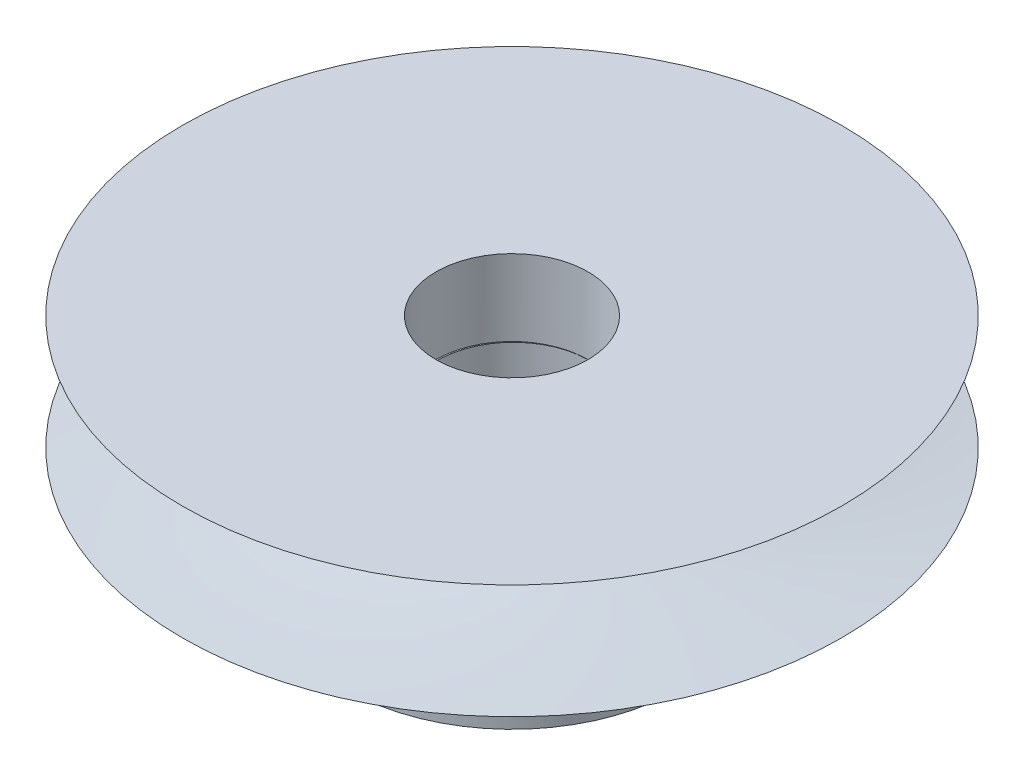
ISO-10303-21;
HEADER;
FILE_DESCRIPTION(('STEP AP214'),'2;1');
FILE_NAME('part.step','',(''),(''),'','','');
FILE_SCHEMA(('AUTOMOTIVE_DESIGN { 1 0 10303 214 1 1 1 1 }'));
ENDSEC;
DATA;
#1=APPLICATION_CONTEXT('core data for automotive mechanical design processes');
#2=APPLICATION_PROTOCOL_DEFINITION('international standard','automotive_design',2000,#1);
#3=PRODUCT_CONTEXT('',#1,'mechanical');
#4=PRODUCT('Part','Part','',(#3));
#5=PRODUCT_RELATED_PRODUCT_CATEGORY('part','',(#4));
#6=PRODUCT_DEFINITION_FORMATION('','',#4);
#7=PRODUCT_DEFINITION_CONTEXT('part definition',#1,'design');
#8=PRODUCT_DEFINITION('design','',#6,#7);
#9=PRODUCT_DEFINITION_SHAPE('','',#8);
#10=(LENGTH_UNIT() NAMED_UNIT(*) SI_UNIT(.MILLI.,.METRE.));
#11=(NAMED_UNIT(*) PLANE_ANGLE_UNIT() SI_UNIT($,.RADIAN.));
#12=(NAMED_UNIT(*) SI_UNIT($,.STERADIAN.) SOLID_ANGLE_UNIT());
#13=UNCERTAINTY_MEASURE_WITH_UNIT(LENGTH_MEASURE(1.E-05),#10,'distance_accuracy_value','');
#14=(GEOMETRIC_REPRESENTATION_CONTEXT(3) GLOBAL_UNCERTAINTY_ASSIGNED_CONTEXT((#13)) GLOBAL_UNIT_ASSIGNED_CONTEXT((#10,
#11,#12)) REPRESENTATION_CONTEXT('',''));
#15=CARTESIAN_POINT('',(0.,0.,0.));
#16=DIRECTION('',(0.,0.,1.));
#17=DIRECTION('',(1.,0.,0.));
#18=AXIS2_PLACEMENT_3D('',#15,#16,#17);
#19=CARTESIAN_POINT('',(1.81538548412725,-5.43164949076936,-0.870852952540729));
#20=DIRECTION('',(-0.991094193323921,0.,-0.133162682308544));
#21=DIRECTION('',(-0.133162682308544,0.,0.991094193323921));
#22=AXIS2_PLACEMENT_3D('',#19,#20,#21);
#23=CYLINDRICAL_SURFACE('',#22,0.799999999999998);
#24=CARTESIAN_POINT('',(11.1064637199141,-5.43164949076936,1.18467810912707));
#25=CARTESIAN_POINT('',(11.1064646215035,-5.38759773556251,1.18467715758625));
#26=CARTESIAN_POINT('',(11.1079681758369,-5.34353473995801,1.18119645745761));
#27=CARTESIAN_POINT('',(11.1138442737868,-5.25668186481119,1.16738080439189));
#28=CARTESIAN_POINT('',(11.1182182592017,-5.21389263637071,1.15704240685055));
#29=CARTESIAN_POINT('',(11.1294309386559,-5.13085686700817,1.12984311543306));
#30=CARTESIAN_POINT('',(11.1362661192587,-5.09060679712655,1.11299151686002));
#31=CARTESIAN_POINT('',(11.1518251800773,-5.01362666236658,1.0732239929227));
#32=CARTESIAN_POINT('',(11.160549210197,-4.97689687720103,1.05030758620757));
#33=CARTESIAN_POINT('',(11.1794198651729,-4.90706592839966,0.998377424258329));
#34=CARTESIAN_POINT('',(11.1895945639355,-4.87406749300912,0.969235704667135));
#35=CARTESIAN_POINT('',(11.2104378907055,-4.81354369326504,0.905879998970768));
#36=CARTESIAN_POINT('',(11.2211065714852,-4.78601891533417,0.871665470072671));
#37=CARTESIAN_POINT('',(11.2423554793976,-4.73678558614286,0.798366246817427));
#38=CARTESIAN_POINT('',(11.2529312947641,-4.71518122330387,0.75921010572635));
#39=CARTESIAN_POINT('',(11.2730802173959,-4.67907972510468,0.677508670663894));
#40=CARTESIAN_POINT('',(11.2826534922524,-4.66458140035582,0.634963945250982));
#41=CARTESIAN_POINT('',(11.3000004716948,-4.64343182174377,0.548682229759524));
#42=CARTESIAN_POINT('',(11.3078102391106,-4.63660914297522,0.504994560907715));
#43=CARTESIAN_POINT('',(11.3215216325098,-4.63046755458671,0.416803179955576));
#44=CARTESIAN_POINT('',(11.3274235835071,-4.63114736615511,0.372299608218244));
#45=CARTESIAN_POINT('',(11.3370332041084,-4.63987076948816,0.284954969708617));
#46=CARTESIAN_POINT('',(11.340793302453,-4.64772492174273,0.242100548928696));
#47=CARTESIAN_POINT('',(11.3464089200615,-4.67027018542573,0.158102323145872));
#48=CARTESIAN_POINT('',(11.3482643360579,-4.68496166749592,0.116958611009736));
#49=CARTESIAN_POINT('',(11.3503205499613,-4.72089762873939,0.0371360507078456));
#50=CARTESIAN_POINT('',(11.3505056620975,-4.74220229059902,-0.00151605280361628));
#51=CARTESIAN_POINT('',(11.3495716089676,-4.79071368831498,-0.0749042073237092));
#52=CARTESIAN_POINT('',(11.3484521920092,-4.81792156229645,-0.109639501215548));
#53=CARTESIAN_POINT('',(11.3453437934762,-4.87844633266004,-0.175265709571518));
#54=CARTESIAN_POINT('',(11.3433293443762,-4.91192417269803,-0.206007153634945));
#55=CARTESIAN_POINT('',(11.3389954568624,-4.98352888540917,-0.261472539605345));
#56=CARTESIAN_POINT('',(11.3366759994366,-5.02165604787875,-0.286196106124545));
#57=CARTESIAN_POINT('',(11.3322671337787,-5.10182101184256,-0.328986888747846));
#58=CARTESIAN_POINT('',(11.3301793197852,-5.14388263371187,-0.347009769290822));
#59=CARTESIAN_POINT('',(11.3267212896178,-5.23051243918886,-0.375523101118385));
#60=CARTESIAN_POINT('',(11.3253508992907,-5.2750800115698,-0.386015380672626));
#61=CARTESIAN_POINT('',(11.3236543691757,-5.36405977307406,-0.398870624370594));
#62=CARTESIAN_POINT('',(11.3232988586169,-5.40843837961864,-0.401462385592023));
#63=CARTESIAN_POINT('',(11.3236215561184,-5.49698323869002,-0.399065532821843));
#64=CARTESIAN_POINT('',(11.3242996556331,-5.5411495130265,-0.394077714807751));
#65=CARTESIAN_POINT('',(11.3265265787512,-5.62715035636936,-0.376882066917532));
#66=CARTESIAN_POINT('',(11.3280586606658,-5.66901324947516,-0.364812830544949));
#67=CARTESIAN_POINT('',(11.3316728733436,-5.75017302715915,-0.333987463836652));
#68=CARTESIAN_POINT('',(11.3337550752687,-5.78946957894214,-0.315230468282178));
#69=CARTESIAN_POINT('',(11.3380870701795,-5.86531936835475,-0.271145692445589));
#70=CARTESIAN_POINT('',(11.34033951372,-5.90179489825229,-0.245684581532881));
#71=CARTESIAN_POINT('',(11.3444472713721,-5.97012675707601,-0.189145504872422));
#72=CARTESIAN_POINT('',(11.3463025119562,-6.0019822304189,-0.158066501140895));
#73=CARTESIAN_POINT('',(11.3491233277562,-6.06109498990145,-0.0901911044444434));
#74=CARTESIAN_POINT('',(11.3500622517459,-6.0881967127849,-0.0532578485741481));
#75=CARTESIAN_POINT('',(11.3504333013823,-6.13589160905147,0.0246064406844519));
#76=CARTESIAN_POINT('',(11.3498655116337,-6.1564851478078,0.0655372494788946));
#77=CARTESIAN_POINT('',(11.3468303344725,-6.19038463500052,0.149875307960472));
#78=CARTESIAN_POINT('',(11.3443780920137,-6.20374724471575,0.193260271106206));
#79=CARTESIAN_POINT('',(11.3373736498844,-6.22297513734817,0.281495185539309));
#80=CARTESIAN_POINT('',(11.3328219121443,-6.22884206839295,0.326344812555753));
#81=CARTESIAN_POINT('',(11.3217968285516,-6.23281093454632,0.414758098568233));
#82=CARTESIAN_POINT('',(11.3153861693309,-6.23114371654792,0.458319361294996));
#83=CARTESIAN_POINT('',(11.300820231773,-6.22062994078406,0.544264567087746));
#84=CARTESIAN_POINT('',(11.2926650137177,-6.21178363105674,0.586648550776486));
#85=CARTESIAN_POINT('',(11.275080571494,-6.18728900088858,0.668811464340581));
#86=CARTESIAN_POINT('',(11.2656597472385,-6.17168413522901,0.708605198966532));
#87=CARTESIAN_POINT('',(11.2460555098364,-6.13415745293923,0.784887562101749));
#88=CARTESIAN_POINT('',(11.2358719880907,-6.11223473545135,0.821375718295206));
#89=CARTESIAN_POINT('',(11.2151109686642,-6.06200288376453,0.891131917566509));
#90=CARTESIAN_POINT('',(11.2045302658254,-6.03353701859925,0.92428613883046));
#91=CARTESIAN_POINT('',(11.1839963309592,-5.97132393990898,0.985447106208347));
#92=CARTESIAN_POINT('',(11.174043265389,-5.93757533352973,1.0134524905267));
#93=CARTESIAN_POINT('',(11.1553204372666,-5.8648636274237,1.06419375045383));
#94=CARTESIAN_POINT('',(11.1465813823321,-5.82580247103228,1.08680071316057));
#95=CARTESIAN_POINT('',(11.1313079144879,-5.74412355736698,1.12531187796985));
#96=CARTESIAN_POINT('',(11.1247720476226,-5.70150816890452,1.14122050225761));
#97=CARTESIAN_POINT('',(11.1153480813859,-5.621148415059,1.16384406383107));
#98=CARTESIAN_POINT('',(11.1120370641733,-5.58375425542506,1.17164013695043));
#99=CARTESIAN_POINT('',(11.1075946184198,-5.50812598594202,1.18205727268292));
#100=CARTESIAN_POINT('',(11.1064629372208,-5.46989197397983,1.1846789351846));
#101=CARTESIAN_POINT('',(11.1064637199141,-5.43164949076936,1.18467810912707));
#102=B_SPLINE_CURVE_WITH_KNOTS('',3,(#24,#25,#26,#27,#28,#29,#30,#31,#32,#33,#34,#35,#36,#37,
#38,#39,#40,#41,#42,#43,#44,#45,#46,#47,#48,#49,#50,#51,#52,#53,#54,#55,#56,#57,#58,#59,#60,#61,
#62,#63,#64,#65,#66,#67,#68,#69,#70,#71,#72,#73,#74,#75,#76,#77,#78,#79,#80,#81,#82,#83,#84,#85,
#86,#87,#88,#89,#90,#91,#92,#93,#94,#95,#96,#97,#98,#99,#100,#101),.UNSPECIFIED.,.T.,.F.,(4,2,2,
2,2,2,2,2,2,2,2,2,2,2,2,2,2,2,2,2,2,2,2,2,2,2,2,2,2,2,2,2,2,2,2,2,2,2,4),(0.,0.132014575271934,
0.264095511399198,0.395988640365317,0.527892240547885,0.662825651698496,0.797773511219596,
0.934962594591386,1.07212870779235,1.20616650785879,1.34018146131782,1.47075691547637,
1.60133944876582,1.73314701668557,1.86498001940561,2.00083181327421,2.13669207923951,
2.27343591809643,2.41014654721941,2.54285854682594,2.67555661050479,2.80574034782946,
2.93594093359374,3.06895730921438,3.20199828662668,3.33880269890164,3.47559942953329,
3.6113081053336,3.7469869367745,3.8785372306771,4.01008297970094,4.1407952147677,
4.27152609722201,4.40579373526754,4.54009683430422,4.67734280436968,4.81449802321737,
4.92911662480865,5.04372193746119),.UNSPECIFIED.);
#103=CARTESIAN_POINT('',(11.1064637199141,-5.43164949076936,1.18467810912707));
#104=VERTEX_POINT('',#103);
#105=EDGE_CURVE('E40',#104,#104,#102,.T.);
#106=ORIENTED_EDGE('',*,*,#105,.T.);
#107=EDGE_LOOP('',(#106));
#108=FACE_BOUND('',#107,.T.);
#109=CARTESIAN_POINT('',(14.6232276632152,-5.43164949076936,1.65718790980036));
#110=CARTESIAN_POINT('',(14.6232285423907,-5.38689388208723,1.65718610338816));
#111=CARTESIAN_POINT('',(14.6241932172446,-5.34211011048688,1.65351536227793));
#112=CARTESIAN_POINT('',(14.6279879225404,-5.25378835530042,1.63892462455044));
#113=CARTESIAN_POINT('',(14.6308199146819,-5.21025173214282,1.62799700417297));
#114=CARTESIAN_POINT('',(14.6381507130368,-5.1257158485961,1.59920370558382));
#115=CARTESIAN_POINT('',(14.642648402077,-5.08471490899901,1.58134267718221));
#116=CARTESIAN_POINT('',(14.6530073040293,-5.0063739620068,1.53917613265695));
#117=CARTESIAN_POINT('',(14.6588682794177,-4.96903331849192,1.51487173904977));
#118=CARTESIAN_POINT('',(14.6716068562294,-4.89886477627407,1.46033985308055));
#119=CARTESIAN_POINT('',(14.6784891935206,-4.86605935393636,1.43008454254686));
#120=CARTESIAN_POINT('',(14.6928249730675,-4.80608656379418,1.36453726206844));
#121=CARTESIAN_POINT('',(14.7002784434357,-4.77891947376611,1.32924504412141));
#122=CARTESIAN_POINT('',(14.7153491757765,-4.73091419341167,1.2544572869117));
#123=CARTESIAN_POINT('',(14.72296688137,-4.71009629970239,1.21494880164004));
#124=CARTESIAN_POINT('',(14.7379360486431,-4.67551033759991,1.13291094451407));
#125=CARTESIAN_POINT('',(14.7452875197957,-4.66174201814593,1.09038168030203));
#126=CARTESIAN_POINT('',(14.7593425038368,-4.64171306797088,1.00371794896085));
#127=CARTESIAN_POINT('',(14.7660490831124,-4.63541510978355,0.959592607799138));
#128=CARTESIAN_POINT('',(14.7785994402972,-4.63038999645085,0.870792422805709));
#129=CARTESIAN_POINT('',(14.7844432507854,-4.63166255535966,0.826117599792069));
#130=CARTESIAN_POINT('',(14.7950849286729,-4.64171239317647,0.737740465696337));
#131=CARTESIAN_POINT('',(14.7998882190077,-4.65044952818574,0.694034233195488));
#132=CARTESIAN_POINT('',(14.8084401951434,-4.67511777493138,0.608593787501458));
#133=CARTESIAN_POINT('',(14.8121888616132,-4.69104901852023,0.566859610467281));
#134=CARTESIAN_POINT('',(14.818686810666,-4.72969609794835,0.486444010430453));
#135=CARTESIAN_POINT('',(14.8214334868195,-4.75242935216511,0.44777075117003));
#136=CARTESIAN_POINT('',(14.8260382059198,-4.8040224711038,0.374693012350333));
#137=CARTESIAN_POINT('',(14.8278962098182,-4.83288260496094,0.340288720419042));
#138=CARTESIAN_POINT('',(14.830908169946,-4.89613519918013,0.276519536058027));
#139=CARTESIAN_POINT('',(14.8320574378078,-4.93056263788654,0.247189106186187));
#140=CARTESIAN_POINT('',(14.8338320988496,-5.00385228459629,0.194701435202917));
#141=CARTESIAN_POINT('',(14.8344574905101,-5.04271450546203,0.171544211996561));
#142=CARTESIAN_POINT('',(14.835374044976,-5.12380105148705,0.132086417340071));
#143=CARTESIAN_POINT('',(14.8356650753751,-5.16602670148361,0.115788563802393));
#144=CARTESIAN_POINT('',(14.8360633118534,-5.25262571324516,0.0905641895641914));
#145=CARTESIAN_POINT('',(14.8361705264048,-5.29699897592803,0.0816373291385821));
#146=CARTESIAN_POINT('',(14.8362896290041,-5.38632666118881,0.0714669594083169));
#147=CARTESIAN_POINT('',(14.8363021284823,-5.43127547653657,0.0701741805181361));
#148=CARTESIAN_POINT('',(14.8362464508406,-5.52074740301057,0.0751805424654309));
#149=CARTESIAN_POINT('',(14.8361782753658,-5.56527052279879,0.0814795284940992));
#150=CARTESIAN_POINT('',(14.8358988536232,-5.65248110194662,0.10144044943636));
#151=CARTESIAN_POINT('',(14.8356880686569,-5.69517400949202,0.115078615158611));
#152=CARTESIAN_POINT('',(14.8349962093295,-5.77768258333974,0.149288353446227));
#153=CARTESIAN_POINT('',(14.8345151258527,-5.81749815255307,0.169860159838414));
#154=CARTESIAN_POINT('',(14.8331054192907,-5.89334332008084,0.217449179952169));
#155=CARTESIAN_POINT('',(14.8321745429946,-5.9293527327057,0.244498494502588));
#156=CARTESIAN_POINT('',(14.8296675182739,-5.99635760013778,0.304198701990065));
#157=CARTESIAN_POINT('',(14.8280913458281,-6.02735286823351,0.336849803427388));
#158=CARTESIAN_POINT('',(14.8240954174176,-6.08362105686695,0.407009497784259));
#159=CARTESIAN_POINT('',(14.8216711099469,-6.10886186416613,0.444543598526803));
#160=CARTESIAN_POINT('',(14.8158312504636,-6.15268257787918,0.523247496623109));
#161=CARTESIAN_POINT('',(14.8124157177072,-6.17126261367381,0.564417223338058));
#162=CARTESIAN_POINT('',(14.804524556844,-6.20118117293371,0.649093133566165));
#163=CARTESIAN_POINT('',(14.8000517012225,-6.21253835331013,0.692592980196058));
#164=CARTESIAN_POINT('',(14.7900553801637,-6.22774953022037,0.780767484098668));
#165=CARTESIAN_POINT('',(14.7845319600101,-6.2316038500773,0.825442090662999));
#166=CARTESIAN_POINT('',(14.7725932641062,-6.23169403092554,0.914381634596473));
#167=CARTESIAN_POINT('',(14.7661840440878,-6.22797944776823,0.958647342789999));
#168=CARTESIAN_POINT('',(14.7526669105414,-6.21314210098296,1.04580857745071));
#169=CARTESIAN_POINT('',(14.7455589973586,-6.20201934101534,1.08870410459488));
#170=CARTESIAN_POINT('',(14.7309572839263,-6.17269672960967,1.17191640578135));
#171=CARTESIAN_POINT('',(14.723463608032,-6.15449914658373,1.21223400156988));
#172=CARTESIAN_POINT('',(14.7084659455005,-6.11154858667805,1.2892078841463));
#173=CARTESIAN_POINT('',(14.7009619587625,-6.08679554525455,1.32586413488042));
#174=CARTESIAN_POINT('',(14.6863141325435,-6.03125302080083,1.39475152648839));
#175=CARTESIAN_POINT('',(14.6791728472817,-6.00042664862577,1.4269534691128));
#176=CARTESIAN_POINT('',(14.6657308394642,-5.9336888633646,1.48580002728916));
#177=CARTESIAN_POINT('',(14.6594303166723,-5.89777624595848,1.51244332296023));
#178=CARTESIAN_POINT('',(14.6480534605966,-5.82173354753015,1.55953020684399));
#179=CARTESIAN_POINT('',(14.6429817445171,-5.78158834903103,1.57995048409934));
#180=CARTESIAN_POINT('',(14.6344397952977,-5.69835031402823,1.61387478872132));
#181=CARTESIAN_POINT('',(14.6309678131482,-5.65526075612353,1.62738637123598));
#182=CARTESIAN_POINT('',(14.626702664487,-5.58189625962208,1.64387832601437));
#183=CARTESIAN_POINT('',(14.6254035894691,-5.55208487697699,1.64886257883413));
#184=CARTESIAN_POINT('',(14.6236657951211,-5.49206977036485,1.65551796868654));
#185=CARTESIAN_POINT('',(14.6232270696436,-5.46186604920267,1.65718912939186));
#186=CARTESIAN_POINT('',(14.6232276632152,-5.43164949076936,1.65718790980036));
#187=B_SPLINE_CURVE_WITH_KNOTS('',3,(#109,#110,#111,#112,#113,#114,#115,#116,#117,#118,#119,
#120,#121,#122,#123,#124,#125,#126,#127,#128,#129,#130,#131,#132,#133,#134,#135,#136,#137,#138,
#139,#140,#141,#142,#143,#144,#145,#146,#147,#148,#149,#150,#151,#152,#153,#154,#155,#156,#157,
#158,#159,#160,#161,#162,#163,#164,#165,#166,#167,#168,#169,#170,#171,#172,#173,#174,#175,#176,
#177,#178,#179,#180,#181,#182,#183,#184,#185,#186),.UNSPECIFIED.,.T.,.F.,(4,2,2,2,2,2,2,2,2,2,2,
2,2,2,2,2,2,2,2,2,2,2,2,2,2,2,2,2,2,2,2,2,2,2,2,2,2,2,4),(0.,0.134156444816222,
0.268454051962342,0.402661749135058,0.536846080960288,0.671673254094057,0.806507068006988,
0.941767496346315,1.07702310723883,1.21159999492362,1.34617179953998,1.48002441067543,
1.6138794751396,1.74808028857725,1.8822869982689,2.01737223537042,2.15245786427561,
2.28759696836332,2.42272984361512,2.55698962354853,2.69124666574639,2.82507148757523,
2.95890082290074,3.09340763033806,3.22791944524748,3.36316447844813,3.49840688446776,
3.63329851994902,3.76818434237438,3.90218986536058,4.0361953221355,4.17015784790922,
4.3041216927006,4.43892581295428,4.57376190562698,4.70909704556757,4.84428386868606,
4.93485966775244,5.02543481963532),.UNSPECIFIED.);
#188=CARTESIAN_POINT('',(14.6232276632152,-5.43164949076936,1.65718790980036));
#189=VERTEX_POINT('',#188);
#190=EDGE_CURVE('E99',#189,#189,#187,.T.);
#191=ORIENTED_EDGE('',*,*,#190,.F.);
#192=EDGE_LOOP('',(#191));
#193=FACE_BOUND('',#192,.T.);
#194=ADVANCED_FACE('F35',(#108,#193),#23,.F.);
#195=CARTESIAN_POINT('',(-4.7030891410279,1.56463653790778,0.));
#196=CARTESIAN_POINT('',(8.2969108589721,-1.43536346209222,0.));
#197=CARTESIAN_POINT('',(-4.7030891410279,-2.93536346209222,0.));
#198=B_SPLINE_CURVE_WITH_KNOTS('',2,(#195,#196,#197),.UNSPECIFIED.,.F.,.F.,(3,3),(0.,1.),.UNSPECIFIED.);
#199=CARTESIAN_POINT('',(8.2969108589721,-2.93536346209222,0.));
#200=DIRECTION('',(0.,-1.,0.));
#201=AXIS1_PLACEMENT('',#199,#200);
#202=SURFACE_OF_REVOLUTION('',#198,#201);
#203=CARTESIAN_POINT('',(8.2969108589721,-2.93536346209222,0.));
#204=DIRECTION('',(0.,-1.,0.));
#205=DIRECTION('',(0.,0.,-1.));
#206=AXIS2_PLACEMENT_3D('',#203,#204,#205);
#207=CIRCLE('',#206,13.);
#208=CARTESIAN_POINT('',(8.2969108589721,-2.93536346209222,-13.));
#209=VERTEX_POINT('',#208);
#210=EDGE_CURVE('E80',#209,#209,#207,.T.);
#211=ORIENTED_EDGE('',*,*,#210,.F.);
#212=EDGE_LOOP('',(#211));
#213=FACE_BOUND('',#212,.T.);
#214=CARTESIAN_POINT('',(8.2969108589721,1.56463653790778,0.));
#215=DIRECTION('',(0.,-1.,0.));
#216=DIRECTION('',(0.,0.,-1.));
#217=AXIS2_PLACEMENT_3D('',#214,#215,#216);
#218=CIRCLE('',#217,13.);
#219=CARTESIAN_POINT('',(8.2969108589721,1.56463653790778,-13.));
#220=VERTEX_POINT('',#219);
#221=EDGE_CURVE('E78',#220,#220,#218,.T.);
#222=ORIENTED_EDGE('',*,*,#221,.T.);
#223=EDGE_LOOP('',(#222));
#224=FACE_BOUND('',#223,.T.);
#225=ADVANCED_FACE('F37',(#213,#224),#202,.T.);
#226=CARTESIAN_POINT('',(-4.7030891410279,-2.93536346209222,0.));
#227=DIRECTION('',(0.,1.,0.));
#228=DIRECTION('',(0.,0.,1.));
#229=AXIS2_PLACEMENT_3D('',#226,#227,#228);
#230=PLANE('',#229);
#231=CARTESIAN_POINT('',(8.29691086,-2.93536346209222,0.));
#232=DIRECTION('',(0.,-1.,0.));
#233=DIRECTION('',(0.,0.,-1.));
#234=AXIS2_PLACEMENT_3D('',#231,#232,#233);
#235=CIRCLE('',#234,6.53976727896577);
#236=CARTESIAN_POINT('',(8.29691086,-2.93536346209222,-6.53976727896577));
#237=VERTEX_POINT('',#236);
#238=EDGE_CURVE('E49',#237,#237,#235,.T.);
#239=ORIENTED_EDGE('',*,*,#238,.F.);
#240=EDGE_LOOP('',(#239));
#241=FACE_BOUND('',#240,.T.);
#242=ORIENTED_EDGE('',*,*,#210,.T.);
#243=EDGE_LOOP('',(#242));
#244=FACE_BOUND('',#243,.T.);
#245=ADVANCED_FACE('F139',(#241,#244),#230,.F.);
#246=CARTESIAN_POINT('',(-4.7030891410279,1.56463653790778,0.));
#247=DIRECTION('',(0.,1.,0.));
#248=DIRECTION('',(0.,0.,1.));
#249=AXIS2_PLACEMENT_3D('',#246,#247,#248);
#250=PLANE('',#249);
#251=CARTESIAN_POINT('',(8.29691086,1.56463653790778,0.));
#252=DIRECTION('',(0.,1.,0.));
#253=DIRECTION('',(0.,0.,1.));
#254=AXIS2_PLACEMENT_3D('',#251,#252,#253);
#255=CIRCLE('',#254,3.);
#256=CARTESIAN_POINT('',(8.29691086,1.56463653790778,3.));
#257=VERTEX_POINT('',#256);
#258=EDGE_CURVE('E74',#257,#257,#255,.T.);
#259=ORIENTED_EDGE('',*,*,#258,.F.);
#260=EDGE_LOOP('',(#259));
#261=FACE_BOUND('',#260,.T.);
#262=ORIENTED_EDGE('',*,*,#221,.F.);
#263=EDGE_LOOP('',(#262));
#264=FACE_BOUND('',#263,.T.);
#265=ADVANCED_FACE('F142',(#261,#264),#250,.T.);
#266=CARTESIAN_POINT('',(8.29691086,-1.43536346209222,0.));
#267=DIRECTION('',(0.,1.,0.));
#268=DIRECTION('',(0.,0.,1.));
#269=AXIS2_PLACEMENT_3D('',#266,#267,#268);
#270=CYLINDRICAL_SURFACE('',#269,3.);
#271=CARTESIAN_POINT('',(8.29691086,-1.43536346209222,0.));
#272=DIRECTION('',(0.,1.,0.));
#273=DIRECTION('',(0.,0.,1.));
#274=AXIS2_PLACEMENT_3D('',#271,#272,#273);
#275=CIRCLE('',#274,3.);
#276=CARTESIAN_POINT('',(8.32359642051543,-1.43536346209222,2.99988131112882));
#277=VERTEX_POINT('',#276);
#278=CARTESIAN_POINT('',(8.32359642051543,-1.43536346209222,-2.99988131112882));
#279=VERTEX_POINT('',#278);
#280=EDGE_CURVE('E61',#277,#279,#275,.T.);
#281=ORIENTED_EDGE('',*,*,#280,.F.);
#282=EDGE_CURVE('E71',#279,#277,#275,.T.);
#283=ORIENTED_EDGE('',*,*,#282,.F.);
#284=EDGE_LOOP('',(#281,#283));
#285=FACE_BOUND('',#284,.T.);
#286=ORIENTED_EDGE('',*,*,#258,.T.);
#287=EDGE_LOOP('',(#286));
#288=FACE_BOUND('',#287,.T.);
#289=ADVANCED_FACE('F76',(#285,#288),#270,.F.);
#290=CARTESIAN_POINT('',(8.29691086,-1.43536346209222,0.));
#291=DIRECTION('',(0.,1.,0.));
#292=DIRECTION('',(0.,0.,1.));
#293=AXIS2_PLACEMENT_3D('',#290,#291,#292);
#294=PLANE('',#293);
#295=CARTESIAN_POINT('',(8.35028198103061,-1.43536346209222,0.));
#296=DIRECTION('',(0.,1.,0.));
#297=DIRECTION('',(0.,0.,1.));
#298=AXIS2_PLACEMENT_3D('',#295,#296,#297);
#299=CIRCLE('',#298,3.);
#300=EDGE_CURVE('E63',#279,#277,#299,.T.);
#301=ORIENTED_EDGE('',*,*,#300,.F.);
#302=ORIENTED_EDGE('',*,*,#282,.T.);
#303=EDGE_LOOP('',(#301,#302));
#304=FACE_BOUND('',#303,.T.);
#305=ADVANCED_FACE('F72',(#304),#294,.T.);
#306=CARTESIAN_POINT('',(8.29691086,-7.93536346209222,0.));
#307=DIRECTION('',(0.,1.,0.));
#308=DIRECTION('',(0.,0.,1.));
#309=AXIS2_PLACEMENT_3D('',#306,#307,#308);
#310=CYLINDRICAL_SURFACE('',#309,6.53976727896577);
#311=ORIENTED_EDGE('',*,*,#190,.T.);
#312=EDGE_LOOP('',(#311));
#313=FACE_BOUND('',#312,.T.);
#314=CARTESIAN_POINT('',(1.75753376509114,-5.43164949076936,-0.0714372004820922));
#315=CARTESIAN_POINT('',(1.75753339390409,-5.47640509945149,-0.0714391748920874));
#316=CARTESIAN_POINT('',(1.7575718359038,-5.52118887105184,-0.0752343639631053));
#317=CARTESIAN_POINT('',(1.75776298493084,-5.6095106262383,-0.090309272843873));
#318=CARTESIAN_POINT('',(1.75791581214776,-5.6530472493959,-0.101596863837775));
#319=CARTESIAN_POINT('',(1.75844509020798,-5.73758313294262,-0.131304009659915));
#320=CARTESIAN_POINT('',(1.75882139127056,-5.77858407253971,-0.149718784699975));
#321=CARTESIAN_POINT('',(1.75995987158675,-5.85692501953192,-0.193124178252256));
#322=CARTESIAN_POINT('',(1.76072198364819,-5.8942656630468,-0.218113651362388));
#323=CARTESIAN_POINT('',(1.76282905875174,-5.96443420526465,-0.274073978032768));
#324=CARTESIAN_POINT('',(1.76417679658596,-5.99723962760236,-0.305072913253345));
#325=CARTESIAN_POINT('',(1.76765086529169,-6.05721241774454,-0.372079565161665));
#326=CARTESIAN_POINT('',(1.76977723450876,-6.08437950777261,-0.408087528476787));
#327=CARTESIAN_POINT('',(1.77498147160936,-6.13238478812706,-0.484200940684797));
#328=CARTESIAN_POINT('',(1.77806232874947,-6.15320268183633,-0.524318993556941));
#329=CARTESIAN_POINT('',(1.78527821836391,-6.18778864393881,-0.607398575330946));
#330=CARTESIAN_POINT('',(1.78941321328874,-6.20155696339279,-0.650360002908436));
#331=CARTESIAN_POINT('',(1.79873188078588,-6.22158591356784,-0.737660102235137));
#332=CARTESIAN_POINT('',(1.80391018688819,-6.22788387175517,-0.781990781049342));
#333=CARTESIAN_POINT('',(1.81524404471924,-6.23290898508787,-0.870954413995605));
#334=CARTESIAN_POINT('',(1.8213995595293,-6.23163642617906,-0.915587356647258));
#335=CARTESIAN_POINT('',(1.83446274033532,-6.22158658836225,-1.00363913940301));
#336=CARTESIAN_POINT('',(1.84136621079027,-6.21284945335298,-1.04706319325725));
#337=CARTESIAN_POINT('',(1.85566983366377,-6.18818120660734,-1.13173085195236));
#338=CARTESIAN_POINT('',(1.86306999518348,-6.17224996301849,-1.1729744168141));
#339=CARTESIAN_POINT('',(1.87802847418032,-6.13360288359037,-1.25225326630926));
#340=CARTESIAN_POINT('',(1.88558715080243,-6.11086962937361,-1.29027998874807));
#341=CARTESIAN_POINT('',(1.90043486279376,-6.05927651043492,-1.36198148662375));
#342=CARTESIAN_POINT('',(1.9077238863014,-6.03041637657778,-1.39565607077983));
#343=CARTESIAN_POINT('',(1.92165084496759,-5.9671637823586,-1.4579587240154));
#344=CARTESIAN_POINT('',(1.92828420570907,-5.93273634365218,-1.48655231522669));
#345=CARTESIAN_POINT('',(1.94042678795012,-5.85944669694243,-1.53764695999089));
#346=CARTESIAN_POINT('',(1.94593600618917,-5.8205844760767,-1.56014799587266));
#347=CARTESIAN_POINT('',(1.95546698084669,-5.73949793005167,-1.59844836340772));
#348=CARTESIAN_POINT('',(1.95948814757316,-5.69727228005511,-1.61424503858912));
#349=CARTESIAN_POINT('',(1.96576209682292,-5.61067326829357,-1.63867995640795));
#350=CARTESIAN_POINT('',(1.96801496084608,-5.5663000056107,-1.64731852895852));
#351=CARTESIAN_POINT('',(1.97058458708726,-5.47697232034991,-1.65715964814589));
#352=CARTESIAN_POINT('',(1.97091376443987,-5.43202350500215,-1.65840987843123));
#353=CARTESIAN_POINT('',(1.96964602062585,-5.34255157852815,-1.6535663687978));
#354=CARTESIAN_POINT('',(1.96804913873479,-5.29802845873993,-1.64747277863184));
#355=CARTESIAN_POINT('',(1.96304989550388,-5.2108178795921,-1.62814600941162));
#356=CARTESIAN_POINT('',(1.95965336318417,-5.1681249720467,-1.614935878346));
#357=CARTESIAN_POINT('',(1.95129090507569,-5.08561639819898,-1.58175675603362));
#358=CARTESIAN_POINT('',(1.94632492635999,-5.04580082898565,-1.56178753684647));
#359=CARTESIAN_POINT('',(1.93512334875583,-4.96995566145788,-1.515514145279));
#360=CARTESIAN_POINT('',(1.92888145004226,-4.93394624883302,-1.48917841576992));
#361=CARTESIAN_POINT('',(1.9155414840795,-4.86694138140094,-1.43093371425029));
#362=CARTESIAN_POINT('',(1.9084433849652,-4.83594611330521,-1.39902453479339));
#363=CARTESIAN_POINT('',(1.89377870091691,-4.77967792467177,-1.33029828654808));
#364=CARTESIAN_POINT('',(1.8862097731917,-4.75443711737259,-1.29345541317541));
#365=CARTESIAN_POINT('',(1.87106835326513,-4.71061640365954,-1.21600126585621));
#366=CARTESIAN_POINT('',(1.86349586113587,-4.69203636786491,-1.17539006512604));
#367=CARTESIAN_POINT('',(1.84875666036845,-4.66211780860501,-1.09163425247125));
#368=CARTESIAN_POINT('',(1.84158895021275,-4.6507606282286,-1.04849648450211));
#369=CARTESIAN_POINT('',(1.82795678485292,-4.63554945131835,-0.96081048994891));
#370=CARTESIAN_POINT('',(1.82149229935585,-4.63169513146142,-0.916262324227641));
#371=CARTESIAN_POINT('',(1.80953168828338,-4.63160495061318,-0.827325724800008));
#372=CARTESIAN_POINT('',(1.80402951827851,-4.63531953377049,-0.782938146037969));
#373=CARTESIAN_POINT('',(1.79406075718562,-4.65015688055576,-0.695300154680545));
#374=CARTESIAN_POINT('',(1.78959416558592,-4.66127964052338,-0.652049741523305));
#375=CARTESIAN_POINT('',(1.78171385508749,-4.69060225192905,-0.567934357613135));
#376=CARTESIAN_POINT('',(1.77829979934093,-4.70879983495499,-0.527068627080866));
#377=CARTESIAN_POINT('',(1.77244804833165,-4.75175039486067,-0.448865906601185));
#378=CARTESIAN_POINT('',(1.77001036268266,-4.77650343628417,-0.41152895140231));
#379=CARTESIAN_POINT('',(1.76595563994075,-4.83204596073789,-0.341218278251094));
#380=CARTESIAN_POINT('',(1.76434384619378,-4.86287233291295,-0.308273397239116));
#381=CARTESIAN_POINT('',(1.76177638226976,-4.92961011817412,-0.24796574339345));
#382=CARTESIAN_POINT('',(1.76082086780073,-4.96552273558024,-0.220604296359939));
#383=CARTESIAN_POINT('',(1.75936549936706,-5.04156543400857,-0.172184368739466));
#384=CARTESIAN_POINT('',(1.75886734495484,-5.08171063250768,-0.151149591123377));
#385=CARTESIAN_POINT('',(1.75815191766239,-5.16494866751048,-0.116173720807695));
#386=CARTESIAN_POINT('',(1.75793433755607,-5.20803822541519,-0.102224879243078));
#387=CARTESIAN_POINT('',(1.7576951148712,-5.28140272191664,-0.0851920040300962));
#388=CARTESIAN_POINT('',(1.75763250762501,-5.31121410456173,-0.0800416203156364));
#389=CARTESIAN_POINT('',(1.75755195819723,-5.37122921117388,-0.0731635642622601));
#390=CARTESIAN_POINT('',(1.7575340156965,-5.40143293233605,-0.0714358674675998));
#391=CARTESIAN_POINT('',(1.75753376509114,-5.43164949076936,-0.0714372004820922));
#392=B_SPLINE_CURVE_WITH_KNOTS('',3,(#314,#315,#316,#317,#318,#319,#320,#321,#322,#323,#324,
#325,#326,#327,#328,#329,#330,#331,#332,#333,#334,#335,#336,#337,#338,#339,#340,#341,#342,#343,
#344,#345,#346,#347,#348,#349,#350,#351,#352,#353,#354,#355,#356,#357,#358,#359,#360,#361,#362,
#363,#364,#365,#366,#367,#368,#369,#370,#371,#372,#373,#374,#375,#376,#377,#378,#379,#380,#381,
#382,#383,#384,#385,#386,#387,#388,#389,#390,#391),.UNSPECIFIED.,.T.,.F.,(4,2,2,2,2,2,2,2,2,2,2,
2,2,2,2,2,2,2,2,2,2,2,2,2,2,2,2,2,2,2,2,2,2,2,2,2,2,2,4),(0.,0.134156444816222,
0.268454051962342,0.402661749135058,0.536846080960288,0.671673254094056,0.806507068006987,
0.941767496346315,1.07702310723883,1.21159999492362,1.34617179953998,1.48002441067543,
1.6138794751396,1.74808028857725,1.8822869982689,2.01737223537042,2.15245786427561,
2.28759696836332,2.42272984361512,2.55698962354853,2.69124666574639,2.82507148757523,
2.95890082290074,3.09340763033806,3.22791944524748,3.36316447844813,3.49840688446776,
3.63329851994902,3.76818434237438,3.90218986536058,4.0361953221355,4.17015784790922,
4.30412169270059,4.43892581295428,4.57376190562698,4.70909704556756,4.84428386868606,
4.93485966775244,5.02543481963532),.UNSPECIFIED.);
#393=CARTESIAN_POINT('',(1.75753376509114,-5.43164949076936,-0.0714372004820922));
#394=VERTEX_POINT('',#393);
#395=EDGE_CURVE('E11',#394,#394,#392,.T.);
#396=ORIENTED_EDGE('',*,*,#395,.T.);
#397=EDGE_LOOP('',(#396));
#398=FACE_BOUND('',#397,.T.);
#399=CARTESIAN_POINT('',(8.29691086,-7.93536346209222,0.));
#400=DIRECTION('',(0.,-1.,0.));
#401=DIRECTION('',(0.,0.,-1.));
#402=AXIS2_PLACEMENT_3D('',#399,#400,#401);
#403=CIRCLE('',#402,6.53976727896577);
#404=CARTESIAN_POINT('',(8.29691086,-7.93536346209222,-6.53976727896577));
#405=VERTEX_POINT('',#404);
#406=EDGE_CURVE('E86',#405,#405,#403,.T.);
#407=ORIENTED_EDGE('',*,*,#406,.F.);
#408=EDGE_LOOP('',(#407));
#409=FACE_BOUND('',#408,.T.);
#410=ORIENTED_EDGE('',*,*,#238,.T.);
#411=EDGE_LOOP('',(#410));
#412=FACE_BOUND('',#411,.T.);
#413=ADVANCED_FACE('F102',(#313,#398,#409,#412),#310,.T.);
#414=CARTESIAN_POINT('',(8.29691086,-7.93536346209222,0.));
#415=DIRECTION('',(0.,-1.,0.));
#416=DIRECTION('',(0.,0.,-1.));
#417=AXIS2_PLACEMENT_3D('',#414,#415,#416);
#418=PLANE('',#417);
#419=CARTESIAN_POINT('',(8.35028198103061,-7.93536346209222,0.));
#420=DIRECTION('',(0.,-1.,0.));
#421=DIRECTION('',(0.,0.,-1.));
#422=AXIS2_PLACEMENT_3D('',#419,#420,#421);
#423=CIRCLE('',#422,3.);
#424=CARTESIAN_POINT('',(8.35028198103061,-7.93536346209222,-3.));
#425=VERTEX_POINT('',#424);
#426=EDGE_CURVE('E121',#425,#425,#423,.T.);
#427=ORIENTED_EDGE('',*,*,#426,.F.);
#428=EDGE_LOOP('',(#427));
#429=FACE_BOUND('',#428,.T.);
#430=ORIENTED_EDGE('',*,*,#406,.T.);
#431=EDGE_LOOP('',(#430));
#432=FACE_BOUND('',#431,.T.);
#433=ADVANCED_FACE('F109',(#429,#432),#418,.T.);
#434=CARTESIAN_POINT('',(5.3791471649988,-5.43164949076936,0.415160095582027));
#435=CARTESIAN_POINT('',(5.37914654654655,-5.47570124597621,0.415158939809546));
#436=CARTESIAN_POINT('',(5.37861505822537,-5.51976424158072,0.411404812855952));
#437=CARTESIAN_POINT('',(5.37659404402947,-5.60661711672753,0.396528109646965));
#438=CARTESIAN_POINT('',(5.3751040367044,-5.64940634516801,0.385401830381004));
#439=CARTESIAN_POINT('',(5.37146835921765,-5.73244211453055,0.356207524714163));
#440=CARTESIAN_POINT('',(5.36932362436184,-5.77269218441217,0.338149391346119));
#441=CARTESIAN_POINT('',(5.364813137431,-5.84967231917214,0.295685337826613));
#442=CARTESIAN_POINT('',(5.36244736782255,-5.88640210433769,0.271278913827546));
#443=CARTESIAN_POINT('',(5.35795310224124,-5.95623305313906,0.216209458444556));
#444=CARTESIAN_POINT('',(5.35583130463465,-5.9892314885296,0.185415590701808));
#445=CARTESIAN_POINT('',(5.35245013979262,-6.04975528827368,0.118805100240931));
#446=CARTESIAN_POINT('',(5.35119086492864,-6.07728006620455,0.0829879400504081));
#447=CARTESIAN_POINT('',(5.35004312920192,-6.12651339539586,0.00667952033150683));
#448=CARTESIAN_POINT('',(5.35017778226103,-6.14811775823485,-0.0338794875997154));
#449=CARTESIAN_POINT('',(5.35230881467969,-6.18421925643404,-0.118001793056199));
#450=CARTESIAN_POINT('',(5.35430488231846,-6.1987175811829,-0.161564586423015));
#451=CARTESIAN_POINT('',(5.36034746928501,-6.21986715979495,-0.249365151721183));
#452=CARTESIAN_POINT('',(5.36434618622529,-6.2266898385635,-0.293564870494327));
#453=CARTESIAN_POINT('',(5.37439948755559,-6.23283142695201,-0.382247749989495));
#454=CARTESIAN_POINT('',(5.3804537214089,-6.23215161538361,-0.426730861114998));
#455=CARTESIAN_POINT('',(5.39423982715559,-6.22342821205056,-0.513514350171495));
#456=CARTESIAN_POINT('',(5.40192465451,-6.21557405979599,-0.55584144726634));
#457=CARTESIAN_POINT('',(5.41867982010453,-6.19302879611299,-0.638342971626122));
#458=CARTESIAN_POINT('',(5.42775023343735,-6.17833731404281,-0.67851728205994));
#459=CARTESIAN_POINT('',(5.44683638829663,-6.14240135279933,-0.756051712098815));
#460=CARTESIAN_POINT('',(5.45686019995858,-6.1210966909397,-0.793381895223593));
#461=CARTESIAN_POINT('',(5.47713218915645,-6.07258529322374,-0.863920821591068));
#462=CARTESIAN_POINT('',(5.4873804096148,-6.04537741924227,-0.897128768132761));
#463=CARTESIAN_POINT('',(5.50770083889527,-5.98485264887869,-0.959607096523325));
#464=CARTESIAN_POINT('',(5.5177581588083,-5.95137480884069,-0.988726586636447));
#465=CARTESIAN_POINT('',(5.5365786307338,-5.87977009612955,-1.04108097000908));
#466=CARTESIAN_POINT('',(5.54534170199923,-5.84164293365997,-1.06431549617547));
#467=CARTESIAN_POINT('',(5.56088898680037,-5.76147796969616,-1.1044249851926));
#468=CARTESIAN_POINT('',(5.56765996010919,-5.71941634782685,-1.12125760563));
#469=CARTESIAN_POINT('',(5.5785215469916,-5.63278654234986,-1.14784696430867));
#470=CARTESIAN_POINT('',(5.58261281112047,-5.58821896996892,-1.15760542001236));
#471=CARTESIAN_POINT('',(5.58764236132919,-5.49923920846466,-1.16955695253599));
#472=CARTESIAN_POINT('',(5.58866936835185,-5.45486060192008,-1.17196295971837));
#473=CARTESIAN_POINT('',(5.58772545745674,-5.3663157428487,-1.16973628751495));
#474=CARTESIAN_POINT('',(5.58575485433613,-5.32214946851222,-1.16510434722663));
#475=CARTESIAN_POINT('',(5.57906805632474,-5.23614862516936,-1.14910634031035));
#476=CARTESIAN_POINT('',(5.57440459162901,-5.19428573206356,-1.13786953299502));
#477=CARTESIAN_POINT('',(5.56278209143573,-5.11312595437957,-1.10909135975142));
#478=CARTESIAN_POINT('',(5.55582275892247,-5.07382940259658,-1.09154917807247));
#479=CARTESIAN_POINT('',(5.54000806461144,-4.99797961318397,-1.05017129648921));
#480=CARTESIAN_POINT('',(5.53111495317008,-4.96150408328643,-1.02620769409508));
#481=CARTESIAN_POINT('',(5.51222918706155,-4.89317222446271,-0.972758010269641));
#482=CARTESIAN_POINT('',(5.50223632933466,-4.86131675111982,-0.943270908258432));
#483=CARTESIAN_POINT('',(5.48159960259569,-4.80220399163727,-0.878547249616639));
#484=CARTESIAN_POINT('',(5.47094531418872,-4.77510226875382,-0.843171649183851));
#485=CARTESIAN_POINT('',(5.45003487025968,-4.72740737248725,-0.768166725650326));
#486=CARTESIAN_POINT('',(5.43977869241581,-4.70681383373092,-0.728537641510002));
#487=CARTESIAN_POINT('',(5.42044490062417,-4.6729143465382,-0.646389452827602));
#488=CARTESIAN_POINT('',(5.41135856144339,-4.65955173682297,-0.603895842007563));
#489=CARTESIAN_POINT('',(5.39482467737105,-4.64032384419055,-0.516941296341207));
#490=CARTESIAN_POINT('',(5.38737677252365,-4.63445691314577,-0.47248079619385));
#491=CARTESIAN_POINT('',(5.37467385766706,-4.6304880469924,-0.384292942348232));
#492=CARTESIAN_POINT('',(5.36935901668611,-4.6321552649908,-0.340584446293783));
#493=CARTESIAN_POINT('',(5.36072283929307,-4.64266904075466,-0.253842522313887));
#494=CARTESIAN_POINT('',(5.35740143401453,-4.65151535048198,-0.21080907111795));
#495=CARTESIAN_POINT('',(5.3526750605835,-4.67600998065014,-0.126918556947101));
#496=CARTESIAN_POINT('',(5.35125808265159,-4.69161484630971,-0.0860494314527457));
#497=CARTESIAN_POINT('',(5.35003206517045,-4.72914152859949,-0.00729778429062301));
#498=CARTESIAN_POINT('',(5.35022325503831,-4.75106424608737,0.0305843104769354));
#499=CARTESIAN_POINT('',(5.35183559870952,-4.80129609777419,0.103346578255571));
#500=CARTESIAN_POINT('',(5.35328988766998,-4.82976196293947,0.138117812110598));
#501=CARTESIAN_POINT('',(5.35695194197822,-4.89197504162974,0.202529734686575));
#502=CARTESIAN_POINT('',(5.35915990622278,-4.92572364800899,0.232169065970485));
#503=CARTESIAN_POINT('',(5.36382540244737,-4.99843535411502,0.286052763847234));
#504=CARTESIAN_POINT('',(5.36628734285756,-5.03749651050643,0.310164683998661));
#505=CARTESIAN_POINT('',(5.37085398567188,-5.11917542417174,0.351341551392402));
#506=CARTESIAN_POINT('',(5.37295892321625,-5.1617908126342,0.368411147765597));
#507=CARTESIAN_POINT('',(5.37607710349401,-5.24215056647972,0.392719862862328));
#508=CARTESIAN_POINT('',(5.37721289584506,-5.27954472611366,0.401113406023585));
#509=CARTESIAN_POINT('',(5.37874815236726,-5.3551729955967,0.412333701409758));
#510=CARTESIAN_POINT('',(5.37914770189342,-5.39340700755889,0.415161098938408));
#511=CARTESIAN_POINT('',(5.3791471649988,-5.43164949076936,0.415160095582027));
#512=B_SPLINE_CURVE_WITH_KNOTS('',3,(#434,#435,#436,#437,#438,#439,#440,#441,#442,#443,#444,
#445,#446,#447,#448,#449,#450,#451,#452,#453,#454,#455,#456,#457,#458,#459,#460,#461,#462,#463,
#464,#465,#466,#467,#468,#469,#470,#471,#472,#473,#474,#475,#476,#477,#478,#479,#480,#481,#482,
#483,#484,#485,#486,#487,#488,#489,#490,#491,#492,#493,#494,#495,#496,#497,#498,#499,#500,#501,
#502,#503,#504,#505,#506,#507,#508,#509,#510,#511),.UNSPECIFIED.,.T.,.F.,(4,2,2,2,2,2,2,2,2,2,2,
2,2,2,2,2,2,2,2,2,2,2,2,2,2,2,2,2,2,2,2,2,2,2,2,2,2,2,4),(0.,0.132014575271934,
0.264095511399198,0.395988640365319,0.527892240547887,0.662825651698497,0.797773511219596,
0.934962594591386,1.07212870779235,1.20616650785879,1.34018146131782,1.47075691547637,
1.60133944876582,1.73314701668557,1.86498001940561,2.00083181327421,2.1366920792395,
2.27343591809643,2.41014654721941,2.54285854682593,2.67555661050479,2.80574034782946,
2.93594093359374,3.06895730921437,3.20199828662668,3.33880269890164,3.47559942953329,
3.6113081053336,3.7469869367745,3.87853723067709,4.01008297970094,4.1407952147677,
4.271526097222,4.40579373526753,4.54009683430422,4.67734280436967,4.81449802321737,
4.92911662480865,5.04372193746119),.UNSPECIFIED.);
#513=CARTESIAN_POINT('',(5.3791471649988,-5.43164949076936,0.415160095582027));
#514=VERTEX_POINT('',#513);
#515=EDGE_CURVE('E70',#514,#514,#512,.T.);
#516=ORIENTED_EDGE('',*,*,#515,.T.);
#517=EDGE_LOOP('',(#516));
#518=FACE_BOUND('',#517,.T.);
#519=ORIENTED_EDGE('',*,*,#395,.F.);
#520=EDGE_LOOP('',(#519));
#521=FACE_BOUND('',#520,.T.);
#522=ADVANCED_FACE('F106',(#518,#521),#23,.F.);
#523=CARTESIAN_POINT('',(8.35028198103061,-8.43536346209222,0.));
#524=DIRECTION('',(0.,1.,0.));
#525=DIRECTION('',(0.,0.,1.));
#526=AXIS2_PLACEMENT_3D('',#523,#524,#525);
#527=CYLINDRICAL_SURFACE('',#526,3.);
#528=ORIENTED_EDGE('',*,*,#426,.T.);
#529=EDGE_LOOP('',(#528));
#530=FACE_BOUND('',#529,.T.);
#531=ORIENTED_EDGE('',*,*,#515,.F.);
#532=EDGE_LOOP('',(#531));
#533=FACE_BOUND('',#532,.T.);
#534=ORIENTED_EDGE('',*,*,#300,.T.);
#535=EDGE_CURVE('E56',#277,#279,#299,.T.);
#536=ORIENTED_EDGE('',*,*,#535,.T.);
#537=EDGE_LOOP('',(#534,#536));
#538=FACE_BOUND('',#537,.T.);
#539=ORIENTED_EDGE('',*,*,#105,.F.);
#540=EDGE_LOOP('',(#539));
#541=FACE_BOUND('',#540,.T.);
#542=ADVANCED_FACE('F66',(#530,#533,#538,#541),#527,.F.);
#543=CARTESIAN_POINT('',(8.35028198103061,-1.43536346209222,0.));
#544=DIRECTION('',(0.,1.,0.));
#545=DIRECTION('',(0.,0.,1.));
#546=AXIS2_PLACEMENT_3D('',#543,#544,#545);
#547=PLANE('',#546);
#548=ORIENTED_EDGE('',*,*,#280,.T.);
#549=ORIENTED_EDGE('',*,*,#535,.F.);
#550=EDGE_LOOP('',(#548,#549));
#551=FACE_BOUND('',#550,.T.);
#552=ADVANCED_FACE('F59',(#551),#547,.F.);
#553=CLOSED_SHELL('',(#194,#225,#245,#265,#289,#305,#413,#433,#522,#542,#552));
#554=MANIFOLD_SOLID_BREP('B2',#553);
#555=ADVANCED_BREP_SHAPE_REPRESENTATION('',(#18,#554),#14);
#556=SHAPE_DEFINITION_REPRESENTATION(#9,#555);
ENDSEC;
END-ISO-10303-21;
